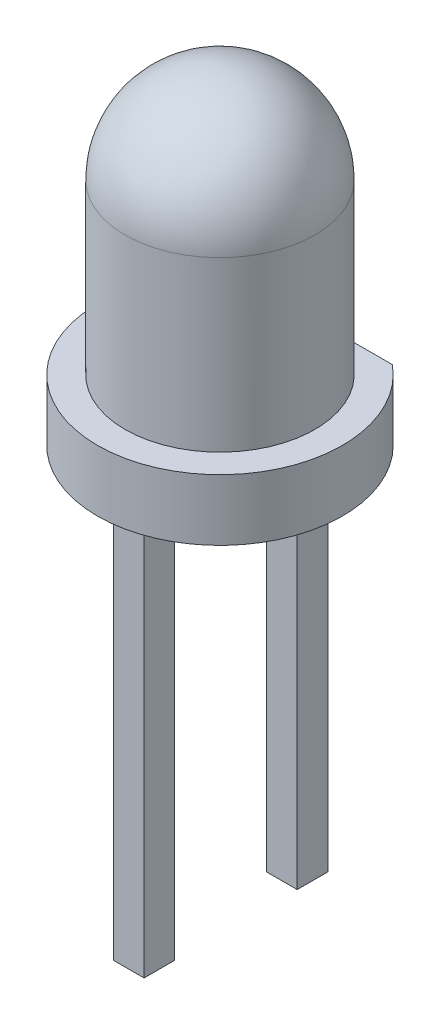
ISO-10303-21;
HEADER;
FILE_DESCRIPTION(('STEP AP214'),'2;1');
FILE_NAME('part.step','',(''),(''),'','','');
FILE_SCHEMA(('AUTOMOTIVE_DESIGN { 1 0 10303 214 1 1 1 1 }'));
ENDSEC;
DATA;
#1=APPLICATION_CONTEXT('core data for automotive mechanical design processes');
#2=APPLICATION_PROTOCOL_DEFINITION('international standard','automotive_design',2000,#1);
#3=PRODUCT_CONTEXT('',#1,'mechanical');
#4=PRODUCT('Part','Part','',(#3));
#5=PRODUCT_RELATED_PRODUCT_CATEGORY('part','',(#4));
#6=PRODUCT_DEFINITION_FORMATION('','',#4);
#7=PRODUCT_DEFINITION_CONTEXT('part definition',#1,'design');
#8=PRODUCT_DEFINITION('design','',#6,#7);
#9=PRODUCT_DEFINITION_SHAPE('','',#8);
#10=(LENGTH_UNIT() NAMED_UNIT(*) SI_UNIT(.MILLI.,.METRE.));
#11=(NAMED_UNIT(*) PLANE_ANGLE_UNIT() SI_UNIT($,.RADIAN.));
#12=(NAMED_UNIT(*) SI_UNIT($,.STERADIAN.) SOLID_ANGLE_UNIT());
#13=UNCERTAINTY_MEASURE_WITH_UNIT(LENGTH_MEASURE(1.E-05),#10,'distance_accuracy_value','');
#14=(GEOMETRIC_REPRESENTATION_CONTEXT(3) GLOBAL_UNCERTAINTY_ASSIGNED_CONTEXT((#13)) GLOBAL_UNIT_ASSIGNED_CONTEXT((#10,
#11,#12)) REPRESENTATION_CONTEXT('',''));
#15=CARTESIAN_POINT('',(0.,0.,0.));
#16=DIRECTION('',(0.,0.,1.));
#17=DIRECTION('',(1.,0.,0.));
#18=AXIS2_PLACEMENT_3D('',#15,#16,#17);
#19=CARTESIAN_POINT('',(-0.0141720166356128,-6.985,-1.016));
#20=DIRECTION('',(0.707106781186547,0.707106781186548,0.));
#21=DIRECTION('',(-0.707106781186548,0.707106781186547,0.));
#22=AXIS2_PLACEMENT_3D('',#19,#20,#21);
#23=PLANE('',#22);
#24=DIRECTION('',(0.,0.,-1.));
#25=VECTOR('',#24,1.);
#26=CARTESIAN_POINT('',(-0.242772016635612,-6.7564,-1.524));
#27=LINE('',#26,#25);
#28=CARTESIAN_POINT('',(-0.242772016635613,-6.7564,-1.016));
#29=VERTEX_POINT('',#28);
#30=CARTESIAN_POINT('',(-0.242772016635613,-6.7564,-1.524));
#31=VERTEX_POINT('',#30);
#32=EDGE_CURVE('E123',#29,#31,#27,.T.);
#33=ORIENTED_EDGE('',*,*,#32,.T.);
#34=DIRECTION('',(0.577350269189631,-0.577350269189623,0.577350269189623));
#35=VECTOR('',#34,1.);
#36=CARTESIAN_POINT('',(-0.242772016635612,-6.7564,-1.524));
#37=LINE('',#36,#35);
#38=CARTESIAN_POINT('',(-0.0141720166356098,-6.985,-1.2954));
#39=VERTEX_POINT('',#38);
#40=EDGE_CURVE('E120',#31,#39,#37,.T.);
#41=ORIENTED_EDGE('',*,*,#40,.T.);
#42=DIRECTION('',(0.,0.,1.));
#43=VECTOR('',#42,1.);
#44=CARTESIAN_POINT('',(-0.0141720166356094,-6.985,-1.016));
#45=LINE('',#44,#43);
#46=CARTESIAN_POINT('',(-0.0141720166356098,-6.985,-1.2446));
#47=VERTEX_POINT('',#46);
#48=EDGE_CURVE('E117',#39,#47,#45,.T.);
#49=ORIENTED_EDGE('',*,*,#48,.T.);
#50=DIRECTION('',(-0.577350269189631,0.577350269189623,0.577350269189624));
#51=VECTOR('',#50,1.);
#52=CARTESIAN_POINT('',(-0.0141720166356094,-6.985,-1.2446));
#53=LINE('',#52,#51);
#54=EDGE_CURVE('E140',#47,#29,#53,.T.);
#55=ORIENTED_EDGE('',*,*,#54,.T.);
#56=EDGE_LOOP('',(#33,#41,#49,#55));
#57=FACE_BOUND('',#56,.T.);
#58=ADVANCED_FACE('F16',(#57),#23,.F.);
#59=CARTESIAN_POINT('',(-0.0141720166356198,-6.985,1.524));
#60=DIRECTION('',(0.707106781186547,0.707106781186548,0.));
#61=DIRECTION('',(-0.707106781186548,0.707106781186547,0.));
#62=AXIS2_PLACEMENT_3D('',#59,#60,#61);
#63=PLANE('',#62);
#64=DIRECTION('',(0.,0.,-1.));
#65=VECTOR('',#64,1.);
#66=CARTESIAN_POINT('',(-0.242772016635622,-6.7564,1.016));
#67=LINE('',#66,#65);
#68=CARTESIAN_POINT('',(-0.242772016635623,-6.7564,1.524));
#69=VERTEX_POINT('',#68);
#70=CARTESIAN_POINT('',(-0.242772016635623,-6.7564,1.016));
#71=VERTEX_POINT('',#70);
#72=EDGE_CURVE('E231',#69,#71,#67,.T.);
#73=ORIENTED_EDGE('',*,*,#72,.T.);
#74=DIRECTION('',(0.577350269189631,-0.577350269189623,0.577350269189623));
#75=VECTOR('',#74,1.);
#76=CARTESIAN_POINT('',(-0.242772016635622,-6.7564,1.016));
#77=LINE('',#76,#75);
#78=CARTESIAN_POINT('',(-0.0141720166356198,-6.985,1.2446));
#79=VERTEX_POINT('',#78);
#80=EDGE_CURVE('E245',#71,#79,#77,.T.);
#81=ORIENTED_EDGE('',*,*,#80,.T.);
#82=DIRECTION('',(0.,0.,1.));
#83=VECTOR('',#82,1.);
#84=CARTESIAN_POINT('',(-0.0141720166356198,-6.985,1.524));
#85=LINE('',#84,#83);
#86=CARTESIAN_POINT('',(-0.0141720166356197,-6.985,1.2954));
#87=VERTEX_POINT('',#86);
#88=EDGE_CURVE('E240',#79,#87,#85,.T.);
#89=ORIENTED_EDGE('',*,*,#88,.T.);
#90=DIRECTION('',(-0.577350269189631,0.577350269189623,0.577350269189624));
#91=VECTOR('',#90,1.);
#92=CARTESIAN_POINT('',(-0.0141720166356198,-6.985,1.2954));
#93=LINE('',#92,#91);
#94=EDGE_CURVE('E235',#87,#69,#93,.T.);
#95=ORIENTED_EDGE('',*,*,#94,.T.);
#96=EDGE_LOOP('',(#73,#81,#89,#95));
#97=FACE_BOUND('',#96,.T.);
#98=ADVANCED_FACE('F296',(#97),#63,.F.);
#99=CARTESIAN_POINT('',(0.26522798336439,-6.985,-1.2954));
#100=DIRECTION('',(0.,0.707106781186548,0.707106781186547));
#101=DIRECTION('',(0.,-0.707106781186547,0.707106781186548));
#102=AXIS2_PLACEMENT_3D('',#99,#100,#101);
#103=PLANE('',#102);
#104=DIRECTION('',(1.,0.,0.));
#105=VECTOR('',#104,1.);
#106=CARTESIAN_POINT('',(-0.242772016635612,-6.7564,-1.524));
#107=LINE('',#106,#105);
#108=CARTESIAN_POINT('',(0.26522798336439,-6.7564,-1.524));
#109=VERTEX_POINT('',#108);
#110=EDGE_CURVE('E225',#31,#109,#107,.T.);
#111=ORIENTED_EDGE('',*,*,#110,.T.);
#112=DIRECTION('',(-0.577350269189632,-0.577350269189631,0.577350269189614));
#113=VECTOR('',#112,1.);
#114=CARTESIAN_POINT('',(0.26522798336439,-6.7564,-1.524));
#115=LINE('',#114,#113);
#116=CARTESIAN_POINT('',(0.0366279833643873,-6.985,-1.2954));
#117=VERTEX_POINT('',#116);
#118=EDGE_CURVE('E132',#109,#117,#115,.T.);
#119=ORIENTED_EDGE('',*,*,#118,.T.);
#120=DIRECTION('',(1.,0.,0.));
#121=VECTOR('',#120,1.);
#122=CARTESIAN_POINT('',(0.26522798336439,-6.985,-1.2954));
#123=LINE('',#122,#121);
#124=EDGE_CURVE('E127',#117,#39,#123,.F.);
#125=ORIENTED_EDGE('',*,*,#124,.T.);
#126=ORIENTED_EDGE('',*,*,#40,.F.);
#127=EDGE_LOOP('',(#111,#119,#125,#126));
#128=FACE_BOUND('',#127,.T.);
#129=ADVANCED_FACE('F130',(#128),#103,.F.);
#130=CARTESIAN_POINT('',(0.26522798336439,-6.985,-1.016));
#131=DIRECTION('',(0.,1.,0.));
#132=DIRECTION('',(0.,0.,1.));
#133=AXIS2_PLACEMENT_3D('',#130,#131,#132);
#134=PLANE('',#133);
#135=ORIENTED_EDGE('',*,*,#124,.F.);
#136=DIRECTION('',(0.,0.,1.));
#137=VECTOR('',#136,1.);
#138=CARTESIAN_POINT('',(0.0366279833643874,-6.985,-1.016));
#139=LINE('',#138,#137);
#140=CARTESIAN_POINT('',(0.0366279833643874,-6.985,-1.2446));
#141=VERTEX_POINT('',#140);
#142=EDGE_CURVE('E222',#117,#141,#139,.T.);
#143=ORIENTED_EDGE('',*,*,#142,.T.);
#144=DIRECTION('',(1.,0.,0.));
#145=VECTOR('',#144,1.);
#146=CARTESIAN_POINT('',(0.26522798336439,-6.985,-1.2446));
#147=LINE('',#146,#145);
#148=EDGE_CURVE('E137',#141,#47,#147,.F.);
#149=ORIENTED_EDGE('',*,*,#148,.T.);
#150=ORIENTED_EDGE('',*,*,#48,.F.);
#151=EDGE_LOOP('',(#135,#143,#149,#150));
#152=FACE_BOUND('',#151,.T.);
#153=ADVANCED_FACE('F136',(#152),#134,.F.);
#154=CARTESIAN_POINT('',(0.26522798336439,-6.985,-1.2446));
#155=DIRECTION('',(0.,0.707106781186548,-0.707106781186547));
#156=DIRECTION('',(0.,0.707106781186547,0.707106781186548));
#157=AXIS2_PLACEMENT_3D('',#154,#155,#156);
#158=PLANE('',#157);
#159=DIRECTION('',(-1.,0.,0.));
#160=VECTOR('',#159,1.);
#161=CARTESIAN_POINT('',(-0.242772016635612,-6.7564,-1.016));
#162=LINE('',#161,#160);
#163=CARTESIAN_POINT('',(0.26522798336439,-6.7564,-1.016));
#164=VERTEX_POINT('',#163);
#165=EDGE_CURVE('E216',#164,#29,#162,.T.);
#166=ORIENTED_EDGE('',*,*,#165,.T.);
#167=ORIENTED_EDGE('',*,*,#54,.F.);
#168=ORIENTED_EDGE('',*,*,#148,.F.);
#169=DIRECTION('',(0.577350269189632,0.577350269189631,0.577350269189614));
#170=VECTOR('',#169,1.);
#171=CARTESIAN_POINT('',(0.0366279833643874,-6.985,-1.2446));
#172=LINE('',#171,#170);
#173=EDGE_CURVE('E65',#141,#164,#172,.T.);
#174=ORIENTED_EDGE('',*,*,#173,.T.);
#175=EDGE_LOOP('',(#166,#167,#168,#174));
#176=FACE_BOUND('',#175,.T.);
#177=ADVANCED_FACE('F250',(#176),#158,.F.);
#178=CARTESIAN_POINT('',(-0.242772016635612,-6.985,-1.524));
#179=DIRECTION('',(1.,0.,0.));
#180=DIRECTION('',(0.,0.,-1.));
#181=AXIS2_PLACEMENT_3D('',#178,#179,#180);
#182=PLANE('',#181);
#183=ORIENTED_EDGE('',*,*,#32,.F.);
#184=DIRECTION('',(0.,1.,0.));
#185=VECTOR('',#184,1.);
#186=CARTESIAN_POINT('',(-0.242772016635612,-6.985,-1.016));
#187=LINE('',#186,#185);
#188=CARTESIAN_POINT('',(-0.242772016635612,0.,-1.016));
#189=VERTEX_POINT('',#188);
#190=EDGE_CURVE('E213',#29,#189,#187,.T.);
#191=ORIENTED_EDGE('',*,*,#190,.T.);
#192=DIRECTION('',(0.,0.,-1.));
#193=VECTOR('',#192,1.);
#194=CARTESIAN_POINT('',(-0.242772016635612,0.,-1.524));
#195=LINE('',#194,#193);
#196=CARTESIAN_POINT('',(-0.242772016635612,0.,-1.524));
#197=VERTEX_POINT('',#196);
#198=EDGE_CURVE('E248',#197,#189,#195,.F.);
#199=ORIENTED_EDGE('',*,*,#198,.F.);
#200=DIRECTION('',(0.,1.,0.));
#201=VECTOR('',#200,1.);
#202=CARTESIAN_POINT('',(-0.242772016635612,-6.985,-1.524));
#203=LINE('',#202,#201);
#204=EDGE_CURVE('E227',#197,#31,#203,.F.);
#205=ORIENTED_EDGE('',*,*,#204,.T.);
#206=EDGE_LOOP('',(#183,#191,#199,#205));
#207=FACE_BOUND('',#206,.T.);
#208=ADVANCED_FACE('F255',(#207),#182,.F.);
#209=CARTESIAN_POINT('',(0.265227983364379,-6.985,1.2446));
#210=DIRECTION('',(0.,0.707106781186548,0.707106781186547));
#211=DIRECTION('',(0.,-0.707106781186547,0.707106781186548));
#212=AXIS2_PLACEMENT_3D('',#209,#210,#211);
#213=PLANE('',#212);
#214=DIRECTION('',(1.,0.,0.));
#215=VECTOR('',#214,1.);
#216=CARTESIAN_POINT('',(-0.242772016635622,-6.7564,1.016));
#217=LINE('',#216,#215);
#218=CARTESIAN_POINT('',(0.265227983364379,-6.7564,1.016));
#219=VERTEX_POINT('',#218);
#220=EDGE_CURVE('E206',#71,#219,#217,.T.);
#221=ORIENTED_EDGE('',*,*,#220,.T.);
#222=DIRECTION('',(-0.577350269189631,-0.57735026918963,0.577350269189617));
#223=VECTOR('',#222,1.);
#224=CARTESIAN_POINT('',(0.26522798336438,-6.7564,1.016));
#225=LINE('',#224,#223);
#226=CARTESIAN_POINT('',(0.03662798336438,-6.985,1.2446));
#227=VERTEX_POINT('',#226);
#228=EDGE_CURVE('E204',#219,#227,#225,.T.);
#229=ORIENTED_EDGE('',*,*,#228,.T.);
#230=DIRECTION('',(1.,0.,0.));
#231=VECTOR('',#230,1.);
#232=CARTESIAN_POINT('',(0.265227983364379,-6.985,1.2446));
#233=LINE('',#232,#231);
#234=EDGE_CURVE('E242',#227,#79,#233,.F.);
#235=ORIENTED_EDGE('',*,*,#234,.T.);
#236=ORIENTED_EDGE('',*,*,#80,.F.);
#237=EDGE_LOOP('',(#221,#229,#235,#236));
#238=FACE_BOUND('',#237,.T.);
#239=ADVANCED_FACE('F305',(#238),#213,.F.);
#240=CARTESIAN_POINT('',(0.265227983364379,-6.985,1.524));
#241=DIRECTION('',(0.,1.,0.));
#242=DIRECTION('',(0.,0.,1.));
#243=AXIS2_PLACEMENT_3D('',#240,#241,#242);
#244=PLANE('',#243);
#245=ORIENTED_EDGE('',*,*,#234,.F.);
#246=DIRECTION('',(0.,0.,1.));
#247=VECTOR('',#246,1.);
#248=CARTESIAN_POINT('',(0.0366279833643787,-6.985,1.524));
#249=LINE('',#248,#247);
#250=CARTESIAN_POINT('',(0.03662798336438,-6.985,1.2954));
#251=VERTEX_POINT('',#250);
#252=EDGE_CURVE('E202',#227,#251,#249,.T.);
#253=ORIENTED_EDGE('',*,*,#252,.T.);
#254=DIRECTION('',(1.,0.,0.));
#255=VECTOR('',#254,1.);
#256=CARTESIAN_POINT('',(0.265227983364379,-6.985,1.2954));
#257=LINE('',#256,#255);
#258=EDGE_CURVE('E237',#251,#87,#257,.F.);
#259=ORIENTED_EDGE('',*,*,#258,.T.);
#260=ORIENTED_EDGE('',*,*,#88,.F.);
#261=EDGE_LOOP('',(#245,#253,#259,#260));
#262=FACE_BOUND('',#261,.T.);
#263=ADVANCED_FACE('F300',(#262),#244,.F.);
#264=CARTESIAN_POINT('',(0.265227983364379,-6.985,1.2954));
#265=DIRECTION('',(0.,0.707106781186548,-0.707106781186547));
#266=DIRECTION('',(0.,0.707106781186547,0.707106781186548));
#267=AXIS2_PLACEMENT_3D('',#264,#265,#266);
#268=PLANE('',#267);
#269=DIRECTION('',(-1.,0.,0.));
#270=VECTOR('',#269,1.);
#271=CARTESIAN_POINT('',(-0.242772016635622,-6.7564,1.524));
#272=LINE('',#271,#270);
#273=CARTESIAN_POINT('',(0.265227983364379,-6.7564,1.524));
#274=VERTEX_POINT('',#273);
#275=EDGE_CURVE('E193',#274,#69,#272,.T.);
#276=ORIENTED_EDGE('',*,*,#275,.T.);
#277=ORIENTED_EDGE('',*,*,#94,.F.);
#278=ORIENTED_EDGE('',*,*,#258,.F.);
#279=DIRECTION('',(0.577350269189631,0.57735026918963,0.577350269189617));
#280=VECTOR('',#279,1.);
#281=CARTESIAN_POINT('',(0.0366279833643787,-6.985,1.2954));
#282=LINE('',#281,#280);
#283=EDGE_CURVE('E199',#251,#274,#282,.T.);
#284=ORIENTED_EDGE('',*,*,#283,.T.);
#285=EDGE_LOOP('',(#276,#277,#278,#284));
#286=FACE_BOUND('',#285,.T.);
#287=ADVANCED_FACE('F289',(#286),#268,.F.);
#288=CARTESIAN_POINT('',(-0.242772016635622,-6.985,1.016));
#289=DIRECTION('',(1.,0.,0.));
#290=DIRECTION('',(0.,0.,-1.));
#291=AXIS2_PLACEMENT_3D('',#288,#289,#290);
#292=PLANE('',#291);
#293=ORIENTED_EDGE('',*,*,#72,.F.);
#294=DIRECTION('',(0.,1.,0.));
#295=VECTOR('',#294,1.);
#296=CARTESIAN_POINT('',(-0.242772016635622,-6.985,1.524));
#297=LINE('',#296,#295);
#298=CARTESIAN_POINT('',(-0.242772016635622,0.,1.524));
#299=VERTEX_POINT('',#298);
#300=EDGE_CURVE('E190',#69,#299,#297,.T.);
#301=ORIENTED_EDGE('',*,*,#300,.T.);
#302=DIRECTION('',(0.,0.,-1.));
#303=VECTOR('',#302,1.);
#304=CARTESIAN_POINT('',(-0.242772016635622,0.,1.016));
#305=LINE('',#304,#303);
#306=CARTESIAN_POINT('',(-0.242772016635622,0.,1.016));
#307=VERTEX_POINT('',#306);
#308=EDGE_CURVE('E233',#307,#299,#305,.F.);
#309=ORIENTED_EDGE('',*,*,#308,.F.);
#310=DIRECTION('',(0.,1.,0.));
#311=VECTOR('',#310,1.);
#312=CARTESIAN_POINT('',(-0.242772016635622,-6.985,1.016));
#313=LINE('',#312,#311);
#314=EDGE_CURVE('E208',#307,#71,#313,.F.);
#315=ORIENTED_EDGE('',*,*,#314,.T.);
#316=EDGE_LOOP('',(#293,#301,#309,#315));
#317=FACE_BOUND('',#316,.T.);
#318=ADVANCED_FACE('F293',(#317),#292,.F.);
#319=CARTESIAN_POINT('',(-0.242772016635612,-6.985,-1.524));
#320=DIRECTION('',(0.,0.,1.));
#321=DIRECTION('',(1.,0.,0.));
#322=AXIS2_PLACEMENT_3D('',#319,#320,#321);
#323=PLANE('',#322);
#324=ORIENTED_EDGE('',*,*,#110,.F.);
#325=ORIENTED_EDGE('',*,*,#204,.F.);
#326=DIRECTION('',(1.,0.,0.));
#327=VECTOR('',#326,1.);
#328=CARTESIAN_POINT('',(-0.242772016635612,0.,-1.524));
#329=LINE('',#328,#327);
#330=CARTESIAN_POINT('',(0.26522798336439,0.,-1.524));
#331=VERTEX_POINT('',#330);
#332=EDGE_CURVE('E229',#331,#197,#329,.F.);
#333=ORIENTED_EDGE('',*,*,#332,.F.);
#334=DIRECTION('',(0.,1.,0.));
#335=VECTOR('',#334,1.);
#336=CARTESIAN_POINT('',(0.26522798336439,-6.985,-1.524));
#337=LINE('',#336,#335);
#338=EDGE_CURVE('E187',#331,#109,#337,.F.);
#339=ORIENTED_EDGE('',*,*,#338,.T.);
#340=EDGE_LOOP('',(#324,#325,#333,#339));
#341=FACE_BOUND('',#340,.T.);
#342=ADVANCED_FACE('F356',(#341),#323,.F.);
#343=CARTESIAN_POINT('',(0.0366279833643873,-6.985,-1.016));
#344=DIRECTION('',(-0.707106781186547,0.707106781186548,0.));
#345=DIRECTION('',(-0.707106781186548,-0.707106781186547,0.));
#346=AXIS2_PLACEMENT_3D('',#343,#344,#345);
#347=PLANE('',#346);
#348=ORIENTED_EDGE('',*,*,#142,.F.);
#349=ORIENTED_EDGE('',*,*,#118,.F.);
#350=DIRECTION('',(0.,0.,1.));
#351=VECTOR('',#350,1.);
#352=CARTESIAN_POINT('',(0.26522798336439,-6.7564,-1.524));
#353=LINE('',#352,#351);
#354=EDGE_CURVE('E185',#109,#164,#353,.T.);
#355=ORIENTED_EDGE('',*,*,#354,.T.);
#356=ORIENTED_EDGE('',*,*,#173,.F.);
#357=EDGE_LOOP('',(#348,#349,#355,#356));
#358=FACE_BOUND('',#357,.T.);
#359=ADVANCED_FACE('F353',(#358),#347,.F.);
#360=CARTESIAN_POINT('',(-0.242772016635612,-6.985,-1.016));
#361=DIRECTION('',(0.,0.,-1.));
#362=DIRECTION('',(-1.,0.,0.));
#363=AXIS2_PLACEMENT_3D('',#360,#361,#362);
#364=PLANE('',#363);
#365=ORIENTED_EDGE('',*,*,#165,.F.);
#366=DIRECTION('',(0.,1.,0.));
#367=VECTOR('',#366,1.);
#368=CARTESIAN_POINT('',(0.26522798336439,-6.985,-1.016));
#369=LINE('',#368,#367);
#370=CARTESIAN_POINT('',(0.26522798336439,0.,-1.016));
#371=VERTEX_POINT('',#370);
#372=EDGE_CURVE('E181',#164,#371,#369,.T.);
#373=ORIENTED_EDGE('',*,*,#372,.T.);
#374=DIRECTION('',(-1.,0.,0.));
#375=VECTOR('',#374,1.);
#376=CARTESIAN_POINT('',(-0.242772016635612,0.,-1.016));
#377=LINE('',#376,#375);
#378=EDGE_CURVE('E218',#189,#371,#377,.F.);
#379=ORIENTED_EDGE('',*,*,#378,.F.);
#380=ORIENTED_EDGE('',*,*,#190,.F.);
#381=EDGE_LOOP('',(#365,#373,#379,#380));
#382=FACE_BOUND('',#381,.T.);
#383=ADVANCED_FACE('F259',(#382),#364,.F.);
#384=CARTESIAN_POINT('',(-0.242772016635622,-6.985,1.016));
#385=DIRECTION('',(0.,0.,1.));
#386=DIRECTION('',(1.,0.,0.));
#387=AXIS2_PLACEMENT_3D('',#384,#385,#386);
#388=PLANE('',#387);
#389=ORIENTED_EDGE('',*,*,#220,.F.);
#390=ORIENTED_EDGE('',*,*,#314,.F.);
#391=DIRECTION('',(1.,0.,0.));
#392=VECTOR('',#391,1.);
#393=CARTESIAN_POINT('',(-0.242772016635622,0.,1.016));
#394=LINE('',#393,#392);
#395=CARTESIAN_POINT('',(0.265227983364379,0.,1.016));
#396=VERTEX_POINT('',#395);
#397=EDGE_CURVE('E211',#396,#307,#394,.F.);
#398=ORIENTED_EDGE('',*,*,#397,.F.);
#399=DIRECTION('',(0.,1.,0.));
#400=VECTOR('',#399,1.);
#401=CARTESIAN_POINT('',(0.265227983364379,-6.985,1.016));
#402=LINE('',#401,#400);
#403=EDGE_CURVE('E175',#396,#219,#402,.F.);
#404=ORIENTED_EDGE('',*,*,#403,.T.);
#405=EDGE_LOOP('',(#389,#390,#398,#404));
#406=FACE_BOUND('',#405,.T.);
#407=ADVANCED_FACE('F274',(#406),#388,.F.);
#408=CARTESIAN_POINT('',(0.0366279833643769,-6.985,1.524));
#409=DIRECTION('',(-0.707106781186547,0.707106781186548,0.));
#410=DIRECTION('',(-0.707106781186548,-0.707106781186547,0.));
#411=AXIS2_PLACEMENT_3D('',#408,#409,#410);
#412=PLANE('',#411);
#413=ORIENTED_EDGE('',*,*,#252,.F.);
#414=ORIENTED_EDGE('',*,*,#228,.F.);
#415=DIRECTION('',(0.,0.,1.));
#416=VECTOR('',#415,1.);
#417=CARTESIAN_POINT('',(0.265227983364379,-6.7564,1.016));
#418=LINE('',#417,#416);
#419=EDGE_CURVE('E172',#219,#274,#418,.T.);
#420=ORIENTED_EDGE('',*,*,#419,.T.);
#421=ORIENTED_EDGE('',*,*,#283,.F.);
#422=EDGE_LOOP('',(#413,#414,#420,#421));
#423=FACE_BOUND('',#422,.T.);
#424=ADVANCED_FACE('F303',(#423),#412,.F.);
#425=CARTESIAN_POINT('',(-0.242772016635622,-6.985,1.524));
#426=DIRECTION('',(0.,0.,-1.));
#427=DIRECTION('',(-1.,0.,0.));
#428=AXIS2_PLACEMENT_3D('',#425,#426,#427);
#429=PLANE('',#428);
#430=ORIENTED_EDGE('',*,*,#275,.F.);
#431=DIRECTION('',(0.,1.,0.));
#432=VECTOR('',#431,1.);
#433=CARTESIAN_POINT('',(0.265227983364379,-6.985,1.524));
#434=LINE('',#433,#432);
#435=CARTESIAN_POINT('',(0.265227983364379,0.,1.524));
#436=VERTEX_POINT('',#435);
#437=EDGE_CURVE('E169',#274,#436,#434,.T.);
#438=ORIENTED_EDGE('',*,*,#437,.T.);
#439=DIRECTION('',(-1.,0.,0.));
#440=VECTOR('',#439,1.);
#441=CARTESIAN_POINT('',(-0.242772016635622,0.,1.524));
#442=LINE('',#441,#440);
#443=EDGE_CURVE('E196',#299,#436,#442,.F.);
#444=ORIENTED_EDGE('',*,*,#443,.F.);
#445=ORIENTED_EDGE('',*,*,#300,.F.);
#446=EDGE_LOOP('',(#430,#438,#444,#445));
#447=FACE_BOUND('',#446,.T.);
#448=ADVANCED_FACE('F285',(#447),#429,.F.);
#449=CARTESIAN_POINT('',(0.26522798336439,-6.985,-1.524));
#450=DIRECTION('',(-1.,0.,0.));
#451=DIRECTION('',(0.,0.,1.));
#452=AXIS2_PLACEMENT_3D('',#449,#450,#451);
#453=PLANE('',#452);
#454=ORIENTED_EDGE('',*,*,#354,.F.);
#455=ORIENTED_EDGE('',*,*,#338,.F.);
#456=DIRECTION('',(0.,0.,1.));
#457=VECTOR('',#456,1.);
#458=CARTESIAN_POINT('',(0.26522798336439,0.,0.));
#459=LINE('',#458,#457);
#460=EDGE_CURVE('E163',#331,#371,#459,.T.);
#461=ORIENTED_EDGE('',*,*,#460,.T.);
#462=ORIENTED_EDGE('',*,*,#372,.F.);
#463=EDGE_LOOP('',(#454,#455,#461,#462));
#464=FACE_BOUND('',#463,.T.);
#465=ADVANCED_FACE('F341',(#464),#453,.F.);
#466=CARTESIAN_POINT('',(-1.28414522543208,1.016,-1.5748));
#467=DIRECTION('',(0.,0.,1.));
#468=DIRECTION('',(1.,0.,0.));
#469=AXIS2_PLACEMENT_3D('',#466,#467,#468);
#470=PLANE('',#469);
#471=DIRECTION('',(0.,1.,0.));
#472=VECTOR('',#471,1.);
#473=CARTESIAN_POINT('',(-1.28414522543208,1.016,-1.5748));
#474=LINE('',#473,#472);
#475=CARTESIAN_POINT('',(-1.28414522543208,1.016,-1.5748));
#476=VERTEX_POINT('',#475);
#477=CARTESIAN_POINT('',(-1.28414522543208,0.,-1.5748));
#478=VERTEX_POINT('',#477);
#479=EDGE_CURVE('E178',#476,#478,#474,.F.);
#480=ORIENTED_EDGE('',*,*,#479,.F.);
#481=DIRECTION('',(1.,0.,0.));
#482=VECTOR('',#481,1.);
#483=CARTESIAN_POINT('',(0.,1.016,-1.5748));
#484=LINE('',#483,#482);
#485=CARTESIAN_POINT('',(1.28414522543208,1.016,-1.5748));
#486=VERTEX_POINT('',#485);
#487=EDGE_CURVE('E19',#486,#476,#484,.F.);
#488=ORIENTED_EDGE('',*,*,#487,.F.);
#489=DIRECTION('',(0.,1.,0.));
#490=VECTOR('',#489,1.);
#491=CARTESIAN_POINT('',(1.28414522543208,1.016,-1.5748));
#492=LINE('',#491,#490);
#493=CARTESIAN_POINT('',(1.28414522543208,0.,-1.5748));
#494=VERTEX_POINT('',#493);
#495=EDGE_CURVE('E179',#494,#486,#492,.T.);
#496=ORIENTED_EDGE('',*,*,#495,.F.);
#497=DIRECTION('',(1.,0.,0.));
#498=VECTOR('',#497,1.);
#499=CARTESIAN_POINT('',(0.,0.,-1.5748));
#500=LINE('',#499,#498);
#501=EDGE_CURVE('E155',#494,#478,#500,.F.);
#502=ORIENTED_EDGE('',*,*,#501,.T.);
#503=EDGE_LOOP('',(#480,#488,#496,#502));
#504=FACE_BOUND('',#503,.T.);
#505=ADVANCED_FACE('F338',(#504),#470,.F.);
#506=CARTESIAN_POINT('',(0.265227983364379,-6.985,1.016));
#507=DIRECTION('',(-1.,0.,0.));
#508=DIRECTION('',(0.,0.,1.));
#509=AXIS2_PLACEMENT_3D('',#506,#507,#508);
#510=PLANE('',#509);
#511=ORIENTED_EDGE('',*,*,#419,.F.);
#512=ORIENTED_EDGE('',*,*,#403,.F.);
#513=DIRECTION('',(0.,0.,1.));
#514=VECTOR('',#513,1.);
#515=CARTESIAN_POINT('',(0.265227983364379,0.,0.));
#516=LINE('',#515,#514);
#517=EDGE_CURVE('E151',#396,#436,#516,.T.);
#518=ORIENTED_EDGE('',*,*,#517,.T.);
#519=ORIENTED_EDGE('',*,*,#437,.F.);
#520=EDGE_LOOP('',(#511,#512,#518,#519));
#521=FACE_BOUND('',#520,.T.);
#522=ADVANCED_FACE('F279',(#521),#510,.F.);
#523=CARTESIAN_POINT('',(0.,0.,0.));
#524=DIRECTION('',(0.,1.,0.));
#525=DIRECTION('',(0.,0.,1.));
#526=AXIS2_PLACEMENT_3D('',#523,#524,#525);
#527=PLANE('',#526);
#528=ORIENTED_EDGE('',*,*,#397,.T.);
#529=ORIENTED_EDGE('',*,*,#308,.T.);
#530=ORIENTED_EDGE('',*,*,#443,.T.);
#531=ORIENTED_EDGE('',*,*,#517,.F.);
#532=EDGE_LOOP('',(#528,#529,#530,#531));
#533=FACE_BOUND('',#532,.T.);
#534=ORIENTED_EDGE('',*,*,#501,.F.);
#535=CARTESIAN_POINT('',(0.,0.,0.));
#536=DIRECTION('',(0.,-1.,0.));
#537=DIRECTION('',(0.,0.,-1.));
#538=AXIS2_PLACEMENT_3D('',#535,#536,#537);
#539=CIRCLE('',#538,2.032);
#540=EDGE_CURVE('E149',#478,#494,#539,.F.);
#541=ORIENTED_EDGE('',*,*,#540,.F.);
#542=EDGE_LOOP('',(#534,#541));
#543=FACE_BOUND('',#542,.T.);
#544=ORIENTED_EDGE('',*,*,#332,.T.);
#545=ORIENTED_EDGE('',*,*,#198,.T.);
#546=ORIENTED_EDGE('',*,*,#378,.T.);
#547=ORIENTED_EDGE('',*,*,#460,.F.);
#548=EDGE_LOOP('',(#544,#545,#546,#547));
#549=FACE_BOUND('',#548,.T.);
#550=ADVANCED_FACE('F263',(#533,#543,#549),#527,.F.);
#551=CARTESIAN_POINT('',(0.,1.016,0.));
#552=DIRECTION('',(0.,-1.,0.));
#553=DIRECTION('',(0.,0.,-1.));
#554=AXIS2_PLACEMENT_3D('',#551,#552,#553);
#555=CYLINDRICAL_SURFACE('',#554,2.032);
#556=CARTESIAN_POINT('',(0.,1.016,0.));
#557=DIRECTION('',(0.,-1.,0.));
#558=DIRECTION('',(0.,0.,-1.));
#559=AXIS2_PLACEMENT_3D('',#556,#557,#558);
#560=CIRCLE('',#559,2.032);
#561=EDGE_CURVE('E148',#476,#486,#560,.F.);
#562=ORIENTED_EDGE('',*,*,#561,.F.);
#563=ORIENTED_EDGE('',*,*,#479,.T.);
#564=ORIENTED_EDGE('',*,*,#540,.T.);
#565=ORIENTED_EDGE('',*,*,#495,.T.);
#566=EDGE_LOOP('',(#562,#563,#564,#565));
#567=FACE_BOUND('',#566,.T.);
#568=ADVANCED_FACE('F330',(#567),#555,.T.);
#569=CARTESIAN_POINT('',(0.,1.016,0.));
#570=DIRECTION('',(0.,1.,0.));
#571=DIRECTION('',(0.,0.,1.));
#572=AXIS2_PLACEMENT_3D('',#569,#570,#571);
#573=PLANE('',#572);
#574=CARTESIAN_POINT('',(0.,1.016,0.));
#575=DIRECTION('',(0.,-1.,0.));
#576=DIRECTION('',(0.,0.,-1.));
#577=AXIS2_PLACEMENT_3D('',#574,#575,#576);
#578=CIRCLE('',#577,1.5748);
#579=CARTESIAN_POINT('',(0.,1.016,-1.5748));
#580=VERTEX_POINT('',#579);
#581=EDGE_CURVE('E145',#580,#580,#578,.F.);
#582=ORIENTED_EDGE('',*,*,#581,.F.);
#583=EDGE_LOOP('',(#582));
#584=FACE_BOUND('',#583,.T.);
#585=ORIENTED_EDGE('',*,*,#487,.T.);
#586=ORIENTED_EDGE('',*,*,#561,.T.);
#587=EDGE_LOOP('',(#585,#586));
#588=FACE_BOUND('',#587,.T.);
#589=ADVANCED_FACE('F323',(#584,#588),#573,.T.);
#590=CARTESIAN_POINT('',(0.,3.81,0.));
#591=DIRECTION('',(0.,-1.,0.));
#592=DIRECTION('',(0.,0.,-1.));
#593=AXIS2_PLACEMENT_3D('',#590,#591,#592);
#594=CYLINDRICAL_SURFACE('',#593,1.5748);
#595=ORIENTED_EDGE('',*,*,#581,.T.);
#596=EDGE_LOOP('',(#595));
#597=FACE_BOUND('',#596,.T.);
#598=CARTESIAN_POINT('',(0.,3.81,0.));
#599=DIRECTION('',(0.,-1.,0.));
#600=DIRECTION('',(0.,0.,-1.));
#601=AXIS2_PLACEMENT_3D('',#598,#599,#600);
#602=CIRCLE('',#601,1.5748);
#603=CARTESIAN_POINT('',(1.5748,3.81,0.));
#604=VERTEX_POINT('',#603);
#605=CARTESIAN_POINT('',(-1.5748,3.81,0.));
#606=VERTEX_POINT('',#605);
#607=EDGE_CURVE('E25',#604,#606,#602,.F.);
#608=ORIENTED_EDGE('',*,*,#607,.F.);
#609=CARTESIAN_POINT('',(0.,3.81,0.));
#610=DIRECTION('',(0.,-1.,0.));
#611=DIRECTION('',(1.,0.,0.));
#612=AXIS2_PLACEMENT_3D('',#609,#610,#611);
#613=CIRCLE('',#612,1.5748);
#614=EDGE_CURVE('E11',#606,#604,#613,.F.);
#615=ORIENTED_EDGE('',*,*,#614,.F.);
#616=EDGE_LOOP('',(#608,#615));
#617=FACE_BOUND('',#616,.T.);
#618=ADVANCED_FACE('F317',(#597,#617),#594,.T.);
#619=CARTESIAN_POINT('',(0.,3.81,0.));
#620=DIRECTION('',(1.,0.,0.));
#621=DIRECTION('',(0.,0.,-1.));
#622=AXIS2_PLACEMENT_3D('',#619,#620,#621);
#623=SPHERICAL_SURFACE('',#622,1.5748);
#624=ORIENTED_EDGE('',*,*,#614,.T.);
#625=ORIENTED_EDGE('',*,*,#607,.T.);
#626=EDGE_LOOP('',(#624,#625));
#627=FACE_BOUND('',#626,.T.);
#628=ADVANCED_FACE('F315',(#627),#623,.T.);
#629=CLOSED_SHELL('',(#58,#98,#129,#153,#177,#208,#239,#263,#287,#318,#342,#359,#383,#407,#424,
#448,#465,#505,#522,#550,#568,#589,#618,#628));
#630=MANIFOLD_SOLID_BREP('B1',#629);
#631=ADVANCED_BREP_SHAPE_REPRESENTATION('',(#18,#630),#14);
#632=SHAPE_DEFINITION_REPRESENTATION(#9,#631);
ENDSEC;
END-ISO-10303-21;
